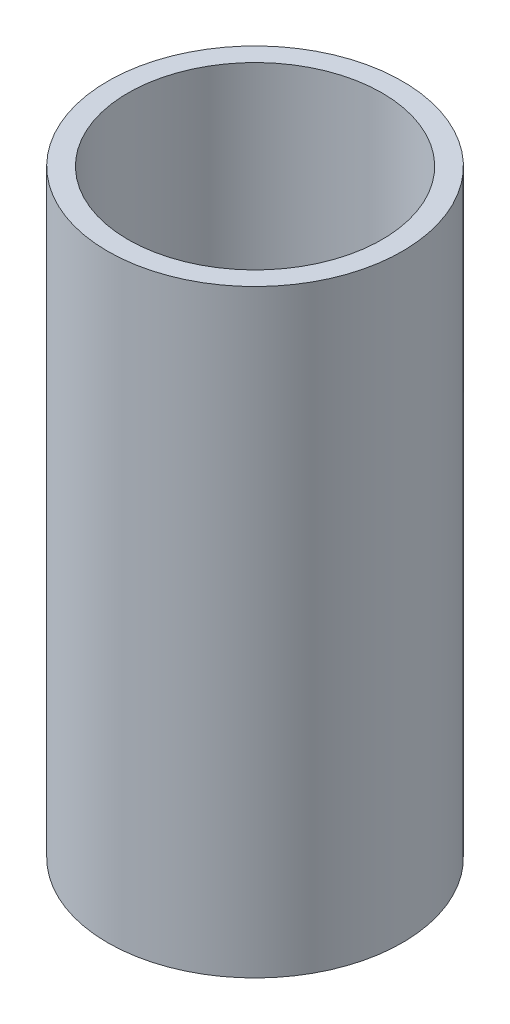
ISO-10303-21;
HEADER;
FILE_DESCRIPTION(('STEP AP214'),'2;1');
FILE_NAME('part.step','',(''),(''),'','','');
FILE_SCHEMA(('AUTOMOTIVE_DESIGN { 1 0 10303 214 1 1 1 1 }'));
ENDSEC;
DATA;
#1=APPLICATION_CONTEXT('core data for automotive mechanical design processes');
#2=APPLICATION_PROTOCOL_DEFINITION('international standard','automotive_design',2000,#1);
#3=PRODUCT_CONTEXT('',#1,'mechanical');
#4=PRODUCT('Part','Part','',(#3));
#5=PRODUCT_RELATED_PRODUCT_CATEGORY('part','',(#4));
#6=PRODUCT_DEFINITION_FORMATION('','',#4);
#7=PRODUCT_DEFINITION_CONTEXT('part definition',#1,'design');
#8=PRODUCT_DEFINITION('design','',#6,#7);
#9=PRODUCT_DEFINITION_SHAPE('','',#8);
#10=(LENGTH_UNIT() NAMED_UNIT(*) SI_UNIT(.MILLI.,.METRE.));
#11=(NAMED_UNIT(*) PLANE_ANGLE_UNIT() SI_UNIT($,.RADIAN.));
#12=(NAMED_UNIT(*) SI_UNIT($,.STERADIAN.) SOLID_ANGLE_UNIT());
#13=UNCERTAINTY_MEASURE_WITH_UNIT(LENGTH_MEASURE(1.E-05),#10,'distance_accuracy_value','');
#14=(GEOMETRIC_REPRESENTATION_CONTEXT(3) GLOBAL_UNCERTAINTY_ASSIGNED_CONTEXT((#13)) GLOBAL_UNIT_ASSIGNED_CONTEXT((#10,
#11,#12)) REPRESENTATION_CONTEXT('',''));
#15=CARTESIAN_POINT('',(0.,0.,0.));
#16=DIRECTION('',(0.,0.,1.));
#17=DIRECTION('',(1.,0.,0.));
#18=AXIS2_PLACEMENT_3D('',#15,#16,#17);
#19=CARTESIAN_POINT('',(0.,132.079813931149,0.));
#20=DIRECTION('',(0.,-1.,0.));
#21=DIRECTION('',(0.,0.,-1.));
#22=AXIS2_PLACEMENT_3D('',#19,#20,#21);
#23=CYLINDRICAL_SURFACE('',#22,32.5);
#24=CARTESIAN_POINT('',(0.,132.079813931149,0.));
#25=DIRECTION('',(0.,1.,0.));
#26=DIRECTION('',(0.,0.,1.));
#27=AXIS2_PLACEMENT_3D('',#24,#25,#26);
#28=CIRCLE('',#27,32.5);
#29=CARTESIAN_POINT('',(0.,132.079813931149,32.5));
#30=VERTEX_POINT('',#29);
#31=EDGE_CURVE('E10',#30,#30,#28,.T.);
#32=ORIENTED_EDGE('',*,*,#31,.F.);
#33=EDGE_LOOP('',(#32));
#34=FACE_BOUND('',#33,.T.);
#35=CARTESIAN_POINT('',(0.,0.,0.));
#36=DIRECTION('',(0.,1.,0.));
#37=DIRECTION('',(0.,0.,1.));
#38=AXIS2_PLACEMENT_3D('',#35,#36,#37);
#39=CIRCLE('',#38,32.5);
#40=CARTESIAN_POINT('',(0.,0.,32.5));
#41=VERTEX_POINT('',#40);
#42=EDGE_CURVE('E37',#41,#41,#39,.T.);
#43=ORIENTED_EDGE('',*,*,#42,.T.);
#44=EDGE_LOOP('',(#43));
#45=FACE_BOUND('',#44,.T.);
#46=ADVANCED_FACE('F40',(#34,#45),#23,.T.);
#47=CARTESIAN_POINT('',(0.,132.079813931149,0.));
#48=DIRECTION('',(0.,1.,0.));
#49=DIRECTION('',(0.,0.,1.));
#50=AXIS2_PLACEMENT_3D('',#47,#48,#49);
#51=PLANE('',#50);
#52=CARTESIAN_POINT('',(0.,132.079813931149,0.));
#53=DIRECTION('',(0.,1.,0.));
#54=DIRECTION('',(0.,0.,1.));
#55=AXIS2_PLACEMENT_3D('',#52,#53,#54);
#56=CIRCLE('',#55,28.0183409462514);
#57=CARTESIAN_POINT('',(0.,132.079813931149,28.0183409462514));
#58=VERTEX_POINT('',#57);
#59=EDGE_CURVE('E50',#58,#58,#56,.T.);
#60=ORIENTED_EDGE('',*,*,#59,.F.);
#61=EDGE_LOOP('',(#60));
#62=FACE_BOUND('',#61,.T.);
#63=ORIENTED_EDGE('',*,*,#31,.T.);
#64=EDGE_LOOP('',(#63));
#65=FACE_BOUND('',#64,.T.);
#66=ADVANCED_FACE('F59',(#62,#65),#51,.T.);
#67=CARTESIAN_POINT('',(0.,0.,0.));
#68=DIRECTION('',(0.,1.,0.));
#69=DIRECTION('',(0.,0.,1.));
#70=AXIS2_PLACEMENT_3D('',#67,#68,#69);
#71=PLANE('',#70);
#72=CARTESIAN_POINT('',(0.,0.,0.));
#73=DIRECTION('',(0.,1.,0.));
#74=DIRECTION('',(0.,0.,1.));
#75=AXIS2_PLACEMENT_3D('',#72,#73,#74);
#76=CIRCLE('',#75,28.0183409462514);
#77=CARTESIAN_POINT('',(0.,0.,28.0183409462514));
#78=VERTEX_POINT('',#77);
#79=EDGE_CURVE('E47',#78,#78,#76,.T.);
#80=ORIENTED_EDGE('',*,*,#79,.T.);
#81=EDGE_LOOP('',(#80));
#82=FACE_BOUND('',#81,.T.);
#83=ORIENTED_EDGE('',*,*,#42,.F.);
#84=EDGE_LOOP('',(#83));
#85=FACE_BOUND('',#84,.T.);
#86=ADVANCED_FACE('F58',(#82,#85),#71,.F.);
#87=CARTESIAN_POINT('',(0.,132.079813931149,0.));
#88=DIRECTION('',(0.,-1.,0.));
#89=DIRECTION('',(0.,0.,-1.));
#90=AXIS2_PLACEMENT_3D('',#87,#88,#89);
#91=CYLINDRICAL_SURFACE('',#90,28.0183409462514);
#92=ORIENTED_EDGE('',*,*,#59,.T.);
#93=EDGE_LOOP('',(#92));
#94=FACE_BOUND('',#93,.T.);
#95=ORIENTED_EDGE('',*,*,#79,.F.);
#96=EDGE_LOOP('',(#95));
#97=FACE_BOUND('',#96,.T.);
#98=ADVANCED_FACE('F54',(#94,#97),#91,.F.);
#99=CLOSED_SHELL('',(#46,#66,#86,#98));
#100=MANIFOLD_SOLID_BREP('B2',#99);
#101=ADVANCED_BREP_SHAPE_REPRESENTATION('',(#18,#100),#14);
#102=SHAPE_DEFINITION_REPRESENTATION(#9,#101);
ENDSEC;
END-ISO-10303-21;
